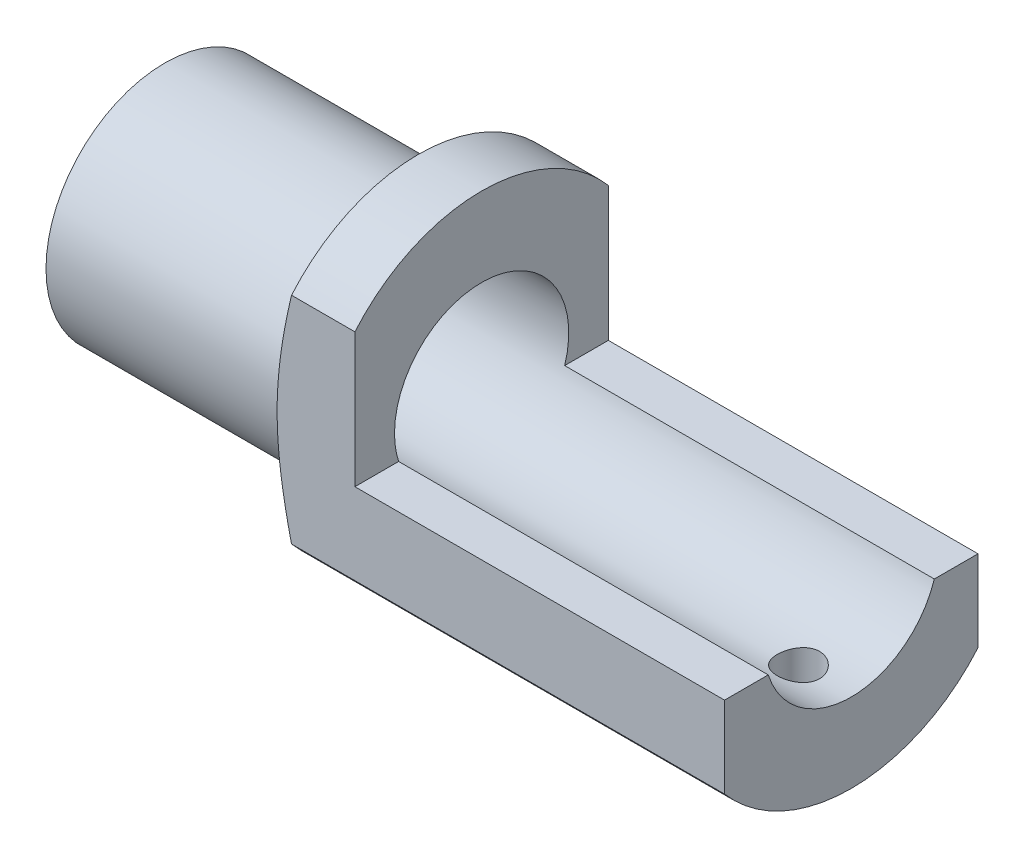
ISO-10303-21;
HEADER;
FILE_DESCRIPTION(('STEP AP214'),'2;1');
FILE_NAME('part.step','',(''),(''),'','','');
FILE_SCHEMA(('AUTOMOTIVE_DESIGN { 1 0 10303 214 1 1 1 1 }'));
ENDSEC;
DATA;
#1=APPLICATION_CONTEXT('core data for automotive mechanical design processes');
#2=APPLICATION_PROTOCOL_DEFINITION('international standard','automotive_design',2000,#1);
#3=PRODUCT_CONTEXT('',#1,'mechanical');
#4=PRODUCT('Part','Part','',(#3));
#5=PRODUCT_RELATED_PRODUCT_CATEGORY('part','',(#4));
#6=PRODUCT_DEFINITION_FORMATION('','',#4);
#7=PRODUCT_DEFINITION_CONTEXT('part definition',#1,'design');
#8=PRODUCT_DEFINITION('design','',#6,#7);
#9=PRODUCT_DEFINITION_SHAPE('','',#8);
#10=(LENGTH_UNIT() NAMED_UNIT(*) SI_UNIT(.MILLI.,.METRE.));
#11=(NAMED_UNIT(*) PLANE_ANGLE_UNIT() SI_UNIT($,.RADIAN.));
#12=(NAMED_UNIT(*) SI_UNIT($,.STERADIAN.) SOLID_ANGLE_UNIT());
#13=UNCERTAINTY_MEASURE_WITH_UNIT(LENGTH_MEASURE(1.E-05),#10,'distance_accuracy_value','');
#14=(GEOMETRIC_REPRESENTATION_CONTEXT(3) GLOBAL_UNCERTAINTY_ASSIGNED_CONTEXT((#13)) GLOBAL_UNIT_ASSIGNED_CONTEXT((#10,
#11,#12)) REPRESENTATION_CONTEXT('',''));
#15=CARTESIAN_POINT('',(0.,0.,0.));
#16=DIRECTION('',(0.,0.,1.));
#17=DIRECTION('',(1.,0.,0.));
#18=AXIS2_PLACEMENT_3D('',#15,#16,#17);
#19=CARTESIAN_POINT('',(13.,1.65,0.));
#20=DIRECTION('',(-1.,0.,0.));
#21=DIRECTION('',(0.,0.,1.));
#22=AXIS2_PLACEMENT_3D('',#19,#20,#21);
#23=PLANE('',#22);
#24=DIRECTION('',(0.,-1.,0.));
#25=VECTOR('',#24,1.);
#26=CARTESIAN_POINT('',(13.,0.554889711844842,2.4));
#27=LINE('',#26,#25);
#28=CARTESIAN_POINT('',(13.,-0.5,2.4));
#29=VERTEX_POINT('',#28);
#30=CARTESIAN_POINT('',(13.,-2.04022057631032,2.4));
#31=VERTEX_POINT('',#30);
#32=EDGE_CURVE('E104',#29,#31,#27,.T.);
#33=ORIENTED_EDGE('',*,*,#32,.T.);
#34=CARTESIAN_POINT('',(13.,0.,0.));
#35=DIRECTION('',(-1.,0.,0.));
#36=DIRECTION('',(0.,0.,1.));
#37=AXIS2_PLACEMENT_3D('',#34,#35,#36);
#38=CIRCLE('',#37,3.15);
#39=CARTESIAN_POINT('',(13.,-2.04022057631032,-2.4));
#40=VERTEX_POINT('',#39);
#41=EDGE_CURVE('E113',#40,#31,#38,.T.);
#42=ORIENTED_EDGE('',*,*,#41,.F.);
#43=DIRECTION('',(0.,-1.,0.));
#44=VECTOR('',#43,1.);
#45=CARTESIAN_POINT('',(13.,0.554889711844842,-2.4));
#46=LINE('',#45,#44);
#47=CARTESIAN_POINT('',(13.,-0.5,-2.4));
#48=VERTEX_POINT('',#47);
#49=EDGE_CURVE('E214',#48,#40,#46,.T.);
#50=ORIENTED_EDGE('',*,*,#49,.F.);
#51=DIRECTION('',(0.,0.,-1.));
#52=VECTOR('',#51,1.);
#53=CARTESIAN_POINT('',(13.,-0.5,-7.07142135623731));
#54=LINE('',#53,#52);
#55=CARTESIAN_POINT('',(13.,-0.5,-1.57241851935164));
#56=VERTEX_POINT('',#55);
#57=EDGE_CURVE('E240',#56,#48,#54,.T.);
#58=ORIENTED_EDGE('',*,*,#57,.F.);
#59=CARTESIAN_POINT('',(13.,0.,0.));
#60=DIRECTION('',(-1.,0.,0.));
#61=DIRECTION('',(0.,0.,1.));
#62=AXIS2_PLACEMENT_3D('',#59,#60,#61);
#63=CIRCLE('',#62,1.65);
#64=CARTESIAN_POINT('',(13.,-0.5,1.57241851935164));
#65=VERTEX_POINT('',#64);
#66=EDGE_CURVE('E119',#56,#65,#63,.T.);
#67=ORIENTED_EDGE('',*,*,#66,.T.);
#68=EDGE_CURVE('E115',#29,#65,#54,.T.);
#69=ORIENTED_EDGE('',*,*,#68,.F.);
#70=EDGE_LOOP('',(#33,#42,#50,#58,#67,#69));
#71=FACE_BOUND('',#70,.T.);
#72=ADVANCED_FACE('F33',(#71),#23,.F.);
#73=CARTESIAN_POINT('',(0.,0.,0.));
#74=DIRECTION('',(-1.,0.,0.));
#75=DIRECTION('',(0.,0.,1.));
#76=AXIS2_PLACEMENT_3D('',#73,#74,#75);
#77=CYLINDRICAL_SURFACE('',#76,3.15);
#78=CARTESIAN_POINT('',(12.,-3.1244999599936,0.4));
#79=CARTESIAN_POINT('',(12.0223707789781,-3.12450028579568,0.39999905067871));
#80=CARTESIAN_POINT('',(12.0447554674382,-3.12474280990166,0.398116972338436));
#81=CARTESIAN_POINT('',(12.0889016652716,-3.12568631387476,0.390638865972868));
#82=CARTESIAN_POINT('',(12.1106625020314,-3.12638777047604,0.385038975835159));
#83=CARTESIAN_POINT('',(12.1529154519492,-3.12816843582754,0.37029317801859));
#84=CARTESIAN_POINT('',(12.1734084232477,-3.12924738570986,0.361149699911176));
#85=CARTESIAN_POINT('',(12.2125653617999,-3.13166115562978,0.339581516200343));
#86=CARTESIAN_POINT('',(12.2312296365391,-3.13299593253946,0.327157363527449));
#87=CARTESIAN_POINT('',(12.2663108417287,-3.13577958696399,0.299303717000151));
#88=CARTESIAN_POINT('',(12.2827156906102,-3.13722901721862,0.283859060153672));
#89=CARTESIAN_POINT('',(12.3127079850487,-3.14007369603757,0.250435471418247));
#90=CARTESIAN_POINT('',(12.326295289402,-3.14146894188355,0.232456412591379));
#91=CARTESIAN_POINT('',(12.3503102338035,-3.14405371170858,0.194398330355441));
#92=CARTESIAN_POINT('',(12.3607269248587,-3.14524251685718,0.17431234507218));
#93=CARTESIAN_POINT('',(12.37803481191,-3.14727438052595,0.132658494406612));
#94=CARTESIAN_POINT('',(12.3849261427648,-3.14811745227151,0.111090685745526));
#95=CARTESIAN_POINT('',(12.3949515514423,-3.1493589644945,0.0672090533447429));
#96=CARTESIAN_POINT('',(12.3981057281432,-3.14975978265779,0.0448998898383334));
#97=CARTESIAN_POINT('',(12.4006295910112,-3.15007974784413,6.55406434916016E-05));
#98=CARTESIAN_POINT('',(12.3999994305496,-3.14999891438752,-0.0224596362534315));
#99=CARTESIAN_POINT('',(12.3949885966707,-3.14936660614305,-0.0669498309707091));
#100=CARTESIAN_POINT('',(12.3906295396446,-3.14881784399363,-0.0889173273782082));
#101=CARTESIAN_POINT('',(12.3783184513179,-3.14731438245107,-0.131806452935487));
#102=CARTESIAN_POINT('',(12.3703663498718,-3.14635967513285,-0.152728061657992));
#103=CARTESIAN_POINT('',(12.3510719790905,-3.1441469232437,-0.192998335120453));
#104=CARTESIAN_POINT('',(12.3397203737279,-3.14288804519476,-0.212342479107475));
#105=CARTESIAN_POINT('',(12.3139560188759,-3.14020775436818,-0.248859400504025));
#106=CARTESIAN_POINT('',(12.2995431245216,-3.13878633390026,-0.266032075094867));
#107=CARTESIAN_POINT('',(12.2679442980326,-3.1359281592755,-0.297845615255187));
#108=CARTESIAN_POINT('',(12.250739524472,-3.13449136767874,-0.312467769554457));
#109=CARTESIAN_POINT('',(12.2141099924757,-3.13177427254381,-0.338619725789632));
#110=CARTESIAN_POINT('',(12.194685226674,-3.1304939695249,-0.350149517464488));
#111=CARTESIAN_POINT('',(12.1541502290875,-3.12823482916814,-0.369790636211338));
#112=CARTESIAN_POINT('',(12.1330392480293,-3.12725612679615,-0.377900433436968));
#113=CARTESIAN_POINT('',(12.0897398853271,-3.1257136111063,-0.390454600220488));
#114=CARTESIAN_POINT('',(12.0675515573857,-3.12514977713104,-0.39489915228199));
#115=CARTESIAN_POINT('',(12.0228926918031,-3.12450462423838,-0.399971819758511));
#116=CARTESIAN_POINT('',(12.0004251930886,-3.1244199744022,-0.400626281693904));
#117=CARTESIAN_POINT('',(11.955700869559,-3.12473396220683,-0.398169735836227));
#118=CARTESIAN_POINT('',(11.9334440401169,-3.12513258920841,-0.395058810937208));
#119=CARTESIAN_POINT('',(11.8898519936737,-3.12636517439419,-0.385181994286194));
#120=CARTESIAN_POINT('',(11.8685138332928,-3.12719760953625,-0.378428886869152));
#121=CARTESIAN_POINT('',(11.8272727017425,-3.1292027798943,-0.361472571257207));
#122=CARTESIAN_POINT('',(11.807369782553,-3.13037552742763,-0.351269238181941));
#123=CARTESIAN_POINT('',(11.7694449840538,-3.13293715240888,-0.327637436543749));
#124=CARTESIAN_POINT('',(11.7514339390159,-3.13432717210138,-0.314191706765579));
#125=CARTESIAN_POINT('',(11.7179147617889,-3.1371631453275,-0.284481157715114));
#126=CARTESIAN_POINT('',(11.7024067301838,-3.13860910110603,-0.268216225207051));
#127=CARTESIAN_POINT('',(11.6742410940226,-3.14140426844521,-0.233213811667295));
#128=CARTESIAN_POINT('',(11.6616008126776,-3.14275286016212,-0.214462334454946));
#129=CARTESIAN_POINT('',(11.639649414153,-3.14519205417118,-0.175087090518309));
#130=CARTESIAN_POINT('',(11.6303382280398,-3.1462826618051,-0.154463362572679));
#131=CARTESIAN_POINT('',(11.615337869389,-3.14808025683615,-0.111986358820647));
#132=CARTESIAN_POINT('',(11.6096387247847,-3.14878829960707,-0.090136651070058));
#133=CARTESIAN_POINT('',(11.6019917982216,-3.14974537358259,-0.0457808524002871));
#134=CARTESIAN_POINT('',(11.60004384141,-3.14999442618191,-0.0232747921250696));
#135=CARTESIAN_POINT('',(11.5999579261811,-3.15000534931544,0.0215857826072003));
#136=CARTESIAN_POINT('',(11.6017932713957,-3.14977063349876,0.043940249797542));
#137=CARTESIAN_POINT('',(11.6091652702564,-3.14884718496051,0.088020263267153));
#138=CARTESIAN_POINT('',(11.6147019207467,-3.14815845262601,0.109745810082609));
#139=CARTESIAN_POINT('',(11.6293108999924,-3.14640401151155,0.151947492920995));
#140=CARTESIAN_POINT('',(11.6383819076962,-3.14533844359673,0.172424092464761));
#141=CARTESIAN_POINT('',(11.6597993407709,-3.14294825153939,0.211568667881042));
#142=CARTESIAN_POINT('',(11.6721458101188,-3.14162362391875,0.230236619465713));
#143=CARTESIAN_POINT('',(11.6998623149924,-3.13885197856298,0.265370309354557));
#144=CARTESIAN_POINT('',(11.7152522063379,-3.1374041947083,0.281820324184737));
#145=CARTESIAN_POINT('',(11.7485773798218,-3.1345555239931,0.31191470705552));
#146=CARTESIAN_POINT('',(11.7665132634835,-3.13315464831218,0.32555841019814));
#147=CARTESIAN_POINT('',(11.8045034421642,-3.13055245400674,0.349699571980219));
#148=CARTESIAN_POINT('',(11.8245658925023,-3.12935195267939,0.360184279011251));
#149=CARTESIAN_POINT('',(11.866170921751,-3.12729600919977,0.377620765501319));
#150=CARTESIAN_POINT('',(11.8877118672664,-3.12644019320904,0.384576374684652));
#151=CARTESIAN_POINT('',(11.9244694001303,-3.12537759004158,0.393098250873323));
#152=CARTESIAN_POINT('',(11.9394544552241,-3.12505012544717,0.39568266785411));
#153=CARTESIAN_POINT('',(11.9696242032752,-3.12461120066002,0.399133857930159));
#154=CARTESIAN_POINT('',(11.9848088946484,-3.12449973875438,0.400000644646292));
#155=CARTESIAN_POINT('',(12.,-3.1244999599936,0.4));
#156=B_SPLINE_CURVE_WITH_KNOTS('',3,(#78,#79,#80,#81,#82,#83,#84,#85,#86,#87,#88,#89,#90,#91,
#92,#93,#94,#95,#96,#97,#98,#99,#100,#101,#102,#103,#104,#105,#106,#107,#108,#109,#110,#111,
#112,#113,#114,#115,#116,#117,#118,#119,#120,#121,#122,#123,#124,#125,#126,#127,#128,#129,#130,
#131,#132,#133,#134,#135,#136,#137,#138,#139,#140,#141,#142,#143,#144,#145,#146,#147,#148,#149,
#150,#151,#152,#153,#154,#155),.UNSPECIFIED.,.T.,.F.,(4,2,2,2,2,2,2,2,2,2,2,2,2,2,2,2,2,2,2,2,2,
2,2,2,2,2,2,2,2,2,2,2,2,2,2,2,2,2,4),(0.,0.0670568391932324,0.134183447148531,0.201264112632664,
0.268333479434599,0.335748603228831,0.403167104773884,0.470815846331627,0.538461999872588,
0.605742668326027,0.673020610053551,0.739911164587162,0.806803025052902,0.873880301474584,
0.940960752804876,1.00851432666348,1.07606812467494,1.14365210916502,1.21123272824142,
1.2783429966033,1.34545178757625,1.41232654027398,1.47920371375176,1.5464450948866,
1.61368917745707,1.68132924319798,1.74896790827565,1.81641901471517,1.88386697700491,
1.95084063124669,2.0178142283883,2.0847628165033,2.15171230352819,2.21911391715884,
2.28653148187047,2.35421764673431,2.42183020163337,2.46736619248519,2.5129018222335),.UNSPECIFIED.);
#157=CARTESIAN_POINT('',(12.,-3.1244999599936,0.4));
#158=VERTEX_POINT('',#157);
#159=EDGE_CURVE('E137',#158,#158,#156,.T.);
#160=ORIENTED_EDGE('',*,*,#159,.T.);
#161=EDGE_LOOP('',(#160));
#162=FACE_BOUND('',#161,.T.);
#163=ORIENTED_EDGE('',*,*,#41,.T.);
#164=DIRECTION('',(1.,0.,0.));
#165=VECTOR('',#164,1.);
#166=CARTESIAN_POINT('',(0.,-2.04022057631032,2.4));
#167=LINE('',#166,#165);
#168=CARTESIAN_POINT('',(4.8,-2.04022057631032,2.4));
#169=VERTEX_POINT('',#168);
#170=EDGE_CURVE('E101',#169,#31,#167,.T.);
#171=ORIENTED_EDGE('',*,*,#170,.F.);
#172=CARTESIAN_POINT('',(4.8,0.,0.));
#173=DIRECTION('',(1.,0.,0.));
#174=DIRECTION('',(0.,0.,-1.));
#175=AXIS2_PLACEMENT_3D('',#172,#173,#174);
#176=CIRCLE('',#175,3.15);
#177=CARTESIAN_POINT('',(4.8,-2.04022057631032,-2.4));
#178=VERTEX_POINT('',#177);
#179=EDGE_CURVE('E60',#169,#178,#176,.T.);
#180=ORIENTED_EDGE('',*,*,#179,.T.);
#181=DIRECTION('',(1.,0.,0.));
#182=VECTOR('',#181,1.);
#183=CARTESIAN_POINT('',(0.,-2.04022057631032,-2.4));
#184=LINE('',#183,#182);
#185=EDGE_CURVE('E118',#178,#40,#184,.T.);
#186=ORIENTED_EDGE('',*,*,#185,.T.);
#187=EDGE_LOOP('',(#163,#171,#180,#186));
#188=FACE_BOUND('',#187,.T.);
#189=ADVANCED_FACE('F117',(#162,#188),#77,.T.);
#190=CARTESIAN_POINT('',(-2.78096834219185,-0.5,-7.07142135623731));
#191=DIRECTION('',(0.,-1.,0.));
#192=DIRECTION('',(0.,0.,-1.));
#193=AXIS2_PLACEMENT_3D('',#190,#191,#192);
#194=PLANE('',#193);
#195=DIRECTION('',(-1.,0.,0.));
#196=VECTOR('',#195,1.);
#197=CARTESIAN_POINT('',(-2.78096834219185,-0.5,2.4));
#198=LINE('',#197,#196);
#199=CARTESIAN_POINT('',(6.,-0.5,2.4));
#200=VERTEX_POINT('',#199);
#201=EDGE_CURVE('E220',#29,#200,#198,.T.);
#202=ORIENTED_EDGE('',*,*,#201,.F.);
#203=ORIENTED_EDGE('',*,*,#68,.T.);
#204=DIRECTION('',(1.,0.,0.));
#205=VECTOR('',#204,1.);
#206=CARTESIAN_POINT('',(-2.78096834219185,-0.5,1.57241851935164));
#207=LINE('',#206,#205);
#208=CARTESIAN_POINT('',(6.,-0.5,1.57241851935164));
#209=VERTEX_POINT('',#208);
#210=EDGE_CURVE('E232',#209,#65,#207,.T.);
#211=ORIENTED_EDGE('',*,*,#210,.F.);
#212=DIRECTION('',(0.,0.,1.));
#213=VECTOR('',#212,1.);
#214=CARTESIAN_POINT('',(6.,-0.5,-7.07142135623731));
#215=LINE('',#214,#213);
#216=EDGE_CURVE('E228',#209,#200,#215,.T.);
#217=ORIENTED_EDGE('',*,*,#216,.T.);
#218=EDGE_LOOP('',(#202,#203,#211,#217));
#219=FACE_BOUND('',#218,.T.);
#220=ADVANCED_FACE('F191',(#219),#194,.F.);
#221=CARTESIAN_POINT('',(6.,3.15,0.));
#222=DIRECTION('',(1.,0.,0.));
#223=DIRECTION('',(0.,0.,-1.));
#224=AXIS2_PLACEMENT_3D('',#221,#222,#223);
#225=PLANE('',#224);
#226=CARTESIAN_POINT('',(6.,0.,0.));
#227=DIRECTION('',(1.,0.,0.));
#228=DIRECTION('',(0.,0.,-1.));
#229=AXIS2_PLACEMENT_3D('',#226,#227,#228);
#230=CIRCLE('',#229,3.15);
#231=CARTESIAN_POINT('',(6.,2.04022057631032,2.4));
#232=VERTEX_POINT('',#231);
#233=CARTESIAN_POINT('',(6.,2.04022057631032,-2.4));
#234=VERTEX_POINT('',#233);
#235=EDGE_CURVE('E230',#232,#234,#230,.F.);
#236=ORIENTED_EDGE('',*,*,#235,.F.);
#237=DIRECTION('',(0.,-1.,0.));
#238=VECTOR('',#237,1.);
#239=CARTESIAN_POINT('',(6.,3.15,2.4));
#240=LINE('',#239,#238);
#241=EDGE_CURVE('E107',#232,#200,#240,.T.);
#242=ORIENTED_EDGE('',*,*,#241,.T.);
#243=ORIENTED_EDGE('',*,*,#216,.F.);
#244=CARTESIAN_POINT('',(6.,0.,0.));
#245=DIRECTION('',(1.,0.,0.));
#246=DIRECTION('',(0.,0.,-1.));
#247=AXIS2_PLACEMENT_3D('',#244,#245,#246);
#248=CIRCLE('',#247,1.65);
#249=CARTESIAN_POINT('',(6.,-0.5,-1.57241851935164));
#250=VERTEX_POINT('',#249);
#251=EDGE_CURVE('E172',#250,#209,#248,.T.);
#252=ORIENTED_EDGE('',*,*,#251,.F.);
#253=DIRECTION('',(0.,0.,1.));
#254=VECTOR('',#253,1.);
#255=CARTESIAN_POINT('',(6.,-0.5,-7.07142135623731));
#256=LINE('',#255,#254);
#257=CARTESIAN_POINT('',(6.,-0.5,-2.4));
#258=VERTEX_POINT('',#257);
#259=EDGE_CURVE('E235',#258,#250,#256,.T.);
#260=ORIENTED_EDGE('',*,*,#259,.F.);
#261=DIRECTION('',(0.,-1.,0.));
#262=VECTOR('',#261,1.);
#263=CARTESIAN_POINT('',(6.,3.15,-2.4));
#264=LINE('',#263,#262);
#265=EDGE_CURVE('E215',#234,#258,#264,.T.);
#266=ORIENTED_EDGE('',*,*,#265,.F.);
#267=EDGE_LOOP('',(#236,#242,#243,#252,#260,#266));
#268=FACE_BOUND('',#267,.T.);
#269=ADVANCED_FACE('F161',(#268),#225,.T.);
#270=CARTESIAN_POINT('',(4.5,0.,0.));
#271=DIRECTION('',(1.,0.,0.));
#272=DIRECTION('',(0.,0.,-1.));
#273=AXIS2_PLACEMENT_3D('',#270,#271,#272);
#274=CONICAL_SURFACE('',#273,2.32575677416361,1.22173047639603);
#275=CARTESIAN_POINT('',(4.5,0.,0.));
#276=DIRECTION('',(1.,0.,0.));
#277=DIRECTION('',(0.,0.,-1.));
#278=AXIS2_PLACEMENT_3D('',#275,#276,#277);
#279=CIRCLE('',#278,2.32575677416361);
#280=CARTESIAN_POINT('',(4.5,0.,-2.32575677416361));
#281=VERTEX_POINT('',#280);
#282=EDGE_CURVE('E131',#281,#281,#279,.F.);
#283=ORIENTED_EDGE('',*,*,#282,.F.);
#284=EDGE_LOOP('',(#283));
#285=FACE_BOUND('',#284,.T.);
#286=ORIENTED_EDGE('',*,*,#179,.F.);
#287=CARTESIAN_POINT('',(5.46407047863291,-4.35727388961923,2.4));
#288=CARTESIAN_POINT('',(5.42669694980541,-4.24002130930115,2.4));
#289=CARTESIAN_POINT('',(5.38962867280827,-4.1226701703377,2.4));
#290=CARTESIAN_POINT('',(5.31627073766991,-3.88771953296638,2.4));
#291=CARTESIAN_POINT('',(5.2799811125539,-3.77012002425577,2.4));
#292=CARTESIAN_POINT('',(5.20833753086117,-3.53458444844181,2.4));
#293=CARTESIAN_POINT('',(5.17298395253765,-3.41664826598908,2.4));
#294=CARTESIAN_POINT('',(5.10346116420305,-3.18042766172044,2.4));
#295=CARTESIAN_POINT('',(5.06929194328252,-3.06214324312313,2.4));
#296=CARTESIAN_POINT('',(5.0027673247053,-2.82631893374267,2.4));
#297=CARTESIAN_POINT('',(4.97039739491359,-2.70878315946497,2.4));
#298=CARTESIAN_POINT('',(4.9074973874617,-2.47322112730624,2.4));
#299=CARTESIAN_POINT('',(4.8769672775219,-2.35519487806944,2.4));
#300=CARTESIAN_POINT('',(4.81822737091367,-2.11849204886095,2.4));
#301=CARTESIAN_POINT('',(4.7900188225624,-1.99981515514287,2.4));
#302=CARTESIAN_POINT('',(4.73658292277888,-1.76180021311783,2.4));
#303=CARTESIAN_POINT('',(4.71135554774703,-1.64246217005251,2.4));
#304=CARTESIAN_POINT('',(4.64479623148707,-1.30111806555658,2.4));
#305=CARTESIAN_POINT('',(4.60802516308214,-1.07815190791642,2.4));
#306=CARTESIAN_POINT('',(4.56702921508705,-0.742145922299226,2.4));
#307=CARTESIAN_POINT('',(4.55572704010216,-0.629965202942296,2.4));
#308=CARTESIAN_POINT('',(4.53848172367656,-0.405185568129831,2.4));
#309=CARTESIAN_POINT('',(4.53253834802895,-0.292586671166791,2.4));
#310=CARTESIAN_POINT('',(4.52638991082147,-0.0665643203531632,2.4));
#311=CARTESIAN_POINT('',(4.52621892424874,0.0468600777695903,2.4));
#312=CARTESIAN_POINT('',(4.53171410920126,0.27356671256549,2.4));
#313=CARTESIAN_POINT('',(4.53738040945945,0.386848946048236,2.4));
#314=CARTESIAN_POINT('',(4.55417604253242,0.613163657391041,2.4));
#315=CARTESIAN_POINT('',(4.56531324393291,0.726195539265347,2.4));
#316=CARTESIAN_POINT('',(4.59239157369104,0.951669607657188,2.4));
#317=CARTESIAN_POINT('',(4.60833264371748,1.06411180131817,2.4));
#318=CARTESIAN_POINT('',(4.65099701913396,1.33048934857976,2.4));
#319=CARTESIAN_POINT('',(4.67952088181211,1.48413384812477,2.4));
#320=CARTESIAN_POINT('',(4.74230734441723,1.79025828563862,2.4));
#321=CARTESIAN_POINT('',(4.77657139811592,1.94273791833635,2.4));
#322=CARTESIAN_POINT('',(4.84934767909488,2.2468137711399,2.4));
#323=CARTESIAN_POINT('',(4.88786368919533,2.39840907619958,2.4));
#324=CARTESIAN_POINT('',(4.96799395371869,2.70075675100054,2.4));
#325=CARTESIAN_POINT('',(5.0096079283326,2.85150919555013,2.4));
#326=CARTESIAN_POINT('',(5.09528649674613,3.15289162268307,2.4));
#327=CARTESIAN_POINT('',(5.13935927235642,3.30351926704048,2.4));
#328=CARTESIAN_POINT('',(5.22925040409629,3.60425400979377,2.4));
#329=CARTESIAN_POINT('',(5.27506879606694,3.75436109743244,2.4));
#330=CARTESIAN_POINT('',(5.41444751204499,4.20390830266439,2.4));
#331=CARTESIAN_POINT('',(5.50997846320591,4.50273622500811,2.4));
#332=CARTESIAN_POINT('',(5.70341452678866,5.09685541108795,2.4));
#333=CARTESIAN_POINT('',(5.80129316160401,5.39215537356505,2.4));
#334=CARTESIAN_POINT('',(5.99912636566274,5.98210998949875,2.4));
#335=CARTESIAN_POINT('',(6.09908126027238,6.27676453369253,2.4));
#336=CARTESIAN_POINT('',(6.29959497484481,6.86327001488511,2.4));
#337=CARTESIAN_POINT('',(6.40014279816954,7.15512472163548,2.4));
#338=CARTESIAN_POINT('',(6.60222908092157,7.73843172277246,2.4));
#339=CARTESIAN_POINT('',(6.70376735676684,8.02988408071795,2.4));
#340=CARTESIAN_POINT('',(6.80562631218978,8.32122307178094,2.4));
#341=B_SPLINE_CURVE_WITH_KNOTS('',3,(#287,#288,#289,#290,#291,#292,#293,#294,#295,#296,#297,
#298,#299,#300,#301,#302,#303,#304,#305,#306,#307,#308,#309,#310,#311,#312,#313,#314,#315,#316,
#317,#318,#319,#320,#321,#322,#323,#324,#325,#326,#327,#328,#329,#330,#331,#332,#333,#334,#335,
#336,#337,#338,#339,#340),.UNSPECIFIED.,.F.,.F.,(4,2,2,2,2,2,2,2,2,2,2,2,2,2,2,2,2,2,2,2,2,2,2,
2,2,2,4),(0.,0.369195817946183,0.738407263883017,1.1077656975809,1.47712072810596,
1.84284370924053,2.20856027189936,2.57447221487169,2.94038126101352,3.61762664797312,
3.9557663263171,4.29389122551252,4.63401176278906,4.97413980109361,5.3147584710786,
5.6553730052523,6.12402422496101,6.59279431610228,7.0619848691192,7.53113309601322,
8.00194822562045,8.47277302723803,9.41391699831814,10.3472041473281,11.2806386699383,
12.2067044300753,13.1326016861812),.UNSPECIFIED.);
#342=CARTESIAN_POINT('',(4.8,2.04022057631032,2.4));
#343=VERTEX_POINT('',#342);
#344=EDGE_CURVE('E12',#169,#343,#341,.T.);
#345=ORIENTED_EDGE('',*,*,#344,.T.);
#346=CARTESIAN_POINT('',(4.8,2.04022057631032,-2.4));
#347=VERTEX_POINT('',#346);
#348=EDGE_CURVE('E134',#347,#343,#176,.T.);
#349=ORIENTED_EDGE('',*,*,#348,.F.);
#350=CARTESIAN_POINT('',(5.46407047863291,-4.35727388961923,-2.4));
#351=CARTESIAN_POINT('',(5.42669694980541,-4.24002130930115,-2.4));
#352=CARTESIAN_POINT('',(5.38962867280827,-4.1226701703377,-2.4));
#353=CARTESIAN_POINT('',(5.31627073766991,-3.88771953296638,-2.4));
#354=CARTESIAN_POINT('',(5.2799811125539,-3.77012002425577,-2.4));
#355=CARTESIAN_POINT('',(5.20833753086117,-3.53458444844181,-2.4));
#356=CARTESIAN_POINT('',(5.17298395253764,-3.41664826598908,-2.4));
#357=CARTESIAN_POINT('',(5.10346116420305,-3.18042766172044,-2.4));
#358=CARTESIAN_POINT('',(5.06929194328252,-3.06214324312313,-2.4));
#359=CARTESIAN_POINT('',(5.0027673247053,-2.82631893374267,-2.4));
#360=CARTESIAN_POINT('',(4.97039739491359,-2.70878315946497,-2.4));
#361=CARTESIAN_POINT('',(4.9074973874617,-2.47322112730623,-2.4));
#362=CARTESIAN_POINT('',(4.8769672775219,-2.35519487806944,-2.4));
#363=CARTESIAN_POINT('',(4.81822737091367,-2.11849204886095,-2.4));
#364=CARTESIAN_POINT('',(4.7900188225624,-1.99981515514286,-2.4));
#365=CARTESIAN_POINT('',(4.73658292277888,-1.76180021311783,-2.4));
#366=CARTESIAN_POINT('',(4.71135554774703,-1.64246217005251,-2.4));
#367=CARTESIAN_POINT('',(4.64479623148707,-1.30111806555658,-2.4));
#368=CARTESIAN_POINT('',(4.60802516308214,-1.07815190791642,-2.4));
#369=CARTESIAN_POINT('',(4.56702921508705,-0.742145922299226,-2.4));
#370=CARTESIAN_POINT('',(4.55572704010216,-0.629965202942297,-2.4));
#371=CARTESIAN_POINT('',(4.53848172367656,-0.405185568129832,-2.4));
#372=CARTESIAN_POINT('',(4.53253834802895,-0.292586671166792,-2.4));
#373=CARTESIAN_POINT('',(4.52638991082147,-0.0665643203531649,-2.4));
#374=CARTESIAN_POINT('',(4.52621892424874,0.0468600777695887,-2.4));
#375=CARTESIAN_POINT('',(4.53171410920126,0.273566712565488,-2.4));
#376=CARTESIAN_POINT('',(4.53738040945945,0.386848946048234,-2.4));
#377=CARTESIAN_POINT('',(4.55417604253242,0.61316365739104,-2.4));
#378=CARTESIAN_POINT('',(4.56531324393291,0.726195539265345,-2.4));
#379=CARTESIAN_POINT('',(4.59239157369104,0.951669607657186,-2.4));
#380=CARTESIAN_POINT('',(4.60833264371748,1.06411180131817,-2.4));
#381=CARTESIAN_POINT('',(4.65099701913396,1.33048934857976,-2.4));
#382=CARTESIAN_POINT('',(4.6795208818121,1.48413384812477,-2.4));
#383=CARTESIAN_POINT('',(4.74230734441723,1.79025828563862,-2.4));
#384=CARTESIAN_POINT('',(4.77657139811592,1.94273791833635,-2.4));
#385=CARTESIAN_POINT('',(4.84934767909488,2.2468137711399,-2.4));
#386=CARTESIAN_POINT('',(4.88786368919533,2.39840907619958,-2.4));
#387=CARTESIAN_POINT('',(4.96799395371869,2.70075675100054,-2.4));
#388=CARTESIAN_POINT('',(5.0096079283326,2.85150919555013,-2.4));
#389=CARTESIAN_POINT('',(5.09528649674613,3.15289162268307,-2.4));
#390=CARTESIAN_POINT('',(5.13935927235642,3.30351926704048,-2.4));
#391=CARTESIAN_POINT('',(5.22925040409629,3.60425400979377,-2.4));
#392=CARTESIAN_POINT('',(5.27506879606694,3.75436109743244,-2.4));
#393=CARTESIAN_POINT('',(5.41444751204499,4.20390830266439,-2.4));
#394=CARTESIAN_POINT('',(5.50997846320591,4.50273622500811,-2.4));
#395=CARTESIAN_POINT('',(5.70341452678866,5.09685541108795,-2.4));
#396=CARTESIAN_POINT('',(5.80129316160401,5.39215537356505,-2.4));
#397=CARTESIAN_POINT('',(5.99912636566274,5.98210998949875,-2.4));
#398=CARTESIAN_POINT('',(6.09908126027238,6.27676453369253,-2.4));
#399=CARTESIAN_POINT('',(6.29959497484481,6.86327001488511,-2.4));
#400=CARTESIAN_POINT('',(6.40014279816954,7.15512472163548,-2.4));
#401=CARTESIAN_POINT('',(6.60222908092157,7.73843172277246,-2.4));
#402=CARTESIAN_POINT('',(6.70376735676685,8.02988408071795,-2.4));
#403=CARTESIAN_POINT('',(6.80562631218978,8.32122307178094,-2.4));
#404=B_SPLINE_CURVE_WITH_KNOTS('',3,(#350,#351,#352,#353,#354,#355,#356,#357,#358,#359,#360,
#361,#362,#363,#364,#365,#366,#367,#368,#369,#370,#371,#372,#373,#374,#375,#376,#377,#378,#379,
#380,#381,#382,#383,#384,#385,#386,#387,#388,#389,#390,#391,#392,#393,#394,#395,#396,#397,#398,
#399,#400,#401,#402,#403),.UNSPECIFIED.,.F.,.F.,(4,2,2,2,2,2,2,2,2,2,2,2,2,2,2,2,2,2,2,2,2,2,2,
2,2,2,4),(0.,0.369195817946182,0.738407263883017,1.1077656975809,1.47712072810596,
1.84284370924053,2.20856027189936,2.57447221487169,2.94038126101352,3.61762664797311,
3.9557663263171,4.29389122551251,4.63401176278906,4.9741398010936,5.3147584710786,
5.65537300525229,6.124024224961,6.59279431610228,7.0619848691192,7.53113309601322,
8.00194822562045,8.47277302723803,9.41391699831814,10.3472041473281,11.2806386699383,
12.2067044300753,13.1326016861812),.UNSPECIFIED.);
#405=EDGE_CURVE('E46',#178,#347,#404,.T.);
#406=ORIENTED_EDGE('',*,*,#405,.F.);
#407=EDGE_LOOP('',(#286,#345,#349,#406));
#408=FACE_BOUND('',#407,.T.);
#409=ADVANCED_FACE('F35',(#285,#408),#274,.T.);
#410=CARTESIAN_POINT('',(0.,2.25,0.));
#411=DIRECTION('',(1.,0.,0.));
#412=DIRECTION('',(0.,0.,-1.));
#413=AXIS2_PLACEMENT_3D('',#410,#411,#412);
#414=PLANE('',#413);
#415=CARTESIAN_POINT('',(0.,0.,0.));
#416=DIRECTION('',(-1.,0.,0.));
#417=DIRECTION('',(0.,0.,1.));
#418=AXIS2_PLACEMENT_3D('',#415,#416,#417);
#419=CIRCLE('',#418,1.65);
#420=CARTESIAN_POINT('',(0.,0.,1.65));
#421=VERTEX_POINT('',#420);
#422=EDGE_CURVE('E122',#421,#421,#419,.T.);
#423=ORIENTED_EDGE('',*,*,#422,.F.);
#424=EDGE_LOOP('',(#423));
#425=FACE_BOUND('',#424,.T.);
#426=CARTESIAN_POINT('',(0.,0.,0.));
#427=DIRECTION('',(-1.,0.,0.));
#428=DIRECTION('',(0.,0.,1.));
#429=AXIS2_PLACEMENT_3D('',#426,#427,#428);
#430=CIRCLE('',#429,2.25);
#431=CARTESIAN_POINT('',(0.,0.,2.25));
#432=VERTEX_POINT('',#431);
#433=EDGE_CURVE('E125',#432,#432,#430,.T.);
#434=ORIENTED_EDGE('',*,*,#433,.T.);
#435=EDGE_LOOP('',(#434));
#436=FACE_BOUND('',#435,.T.);
#437=ADVANCED_FACE('F177',(#425,#436),#414,.F.);
#438=CARTESIAN_POINT('',(0.,0.,0.));
#439=DIRECTION('',(-1.,0.,0.));
#440=DIRECTION('',(0.,0.,1.));
#441=AXIS2_PLACEMENT_3D('',#438,#439,#440);
#442=CYLINDRICAL_SURFACE('',#441,1.65);
#443=CARTESIAN_POINT('',(12.,-1.60078105935821,0.4));
#444=CARTESIAN_POINT('',(11.9778889939897,-1.60078149268384,0.399999334870328));
#445=CARTESIAN_POINT('',(11.955770476015,-1.60124417637013,0.398160394624138));
#446=CARTESIAN_POINT('',(11.9121670446289,-1.60304053350639,0.390864004361595));
#447=CARTESIAN_POINT('',(11.8906825309667,-1.60437474470105,0.385404320263816));
#448=CARTESIAN_POINT('',(11.8489841112087,-1.60775437124044,0.371052250583911));
#449=CARTESIAN_POINT('',(11.8287686638779,-1.60979890339409,0.362164126311995));
#450=CARTESIAN_POINT('',(11.7901140522841,-1.61436771514119,0.341220274972143));
#451=CARTESIAN_POINT('',(11.7716749355805,-1.61689200757433,0.329164463124997));
#452=CARTESIAN_POINT('',(11.7367146009939,-1.62219439578771,0.301960974750249));
#453=CARTESIAN_POINT('',(11.7202355688604,-1.62497634720276,0.28675982478472));
#454=CARTESIAN_POINT('',(11.6900342760065,-1.6304470747054,0.253812412882786));
#455=CARTESIAN_POINT('',(11.6763122614438,-1.63313584245545,0.236065923930444));
#456=CARTESIAN_POINT('',(11.6518433690075,-1.63815974509339,0.198244132501644));
#457=CARTESIAN_POINT('',(11.6411377157135,-1.64048979926588,0.178141426502482));
#458=CARTESIAN_POINT('',(11.6232731424466,-1.64448986365978,0.136355973264544));
#459=CARTESIAN_POINT('',(11.6161137313031,-1.64615996528111,0.114673445315729));
#460=CARTESIAN_POINT('',(11.6056793791238,-1.64862469530258,0.0707833592577171));
#461=CARTESIAN_POINT('',(11.602332856909,-1.64943543588715,0.0485937390870254));
#462=CARTESIAN_POINT('',(11.5993948135155,-1.65014616065046,0.00395421876310928));
#463=CARTESIAN_POINT('',(11.5998027690245,-1.65004627175598,-0.0184956446808422));
#464=CARTESIAN_POINT('',(11.6043101528499,-1.64895906758376,-0.0625226908056017));
#465=CARTESIAN_POINT('',(11.6083323453869,-1.64799032050208,-0.0841083078444899));
#466=CARTESIAN_POINT('',(11.6198301532096,-1.64529574794821,-0.126288629957477));
#467=CARTESIAN_POINT('',(11.6273059459628,-1.64356988357083,-0.146883284049662));
#468=CARTESIAN_POINT('',(11.6455626927262,-1.63952621866866,-0.186703316323859));
#469=CARTESIAN_POINT('',(11.6563715833564,-1.63720344360788,-0.205915360197774));
#470=CARTESIAN_POINT('',(11.68096660713,-1.63221862672622,-0.242280273725787));
#471=CARTESIAN_POINT('',(11.6947532303618,-1.62955652908771,-0.259432803692016));
#472=CARTESIAN_POINT('',(11.7253280925948,-1.62410380258509,-0.291652159318641));
#473=CARTESIAN_POINT('',(11.7421838620919,-1.62131162706011,-0.306654705262366));
#474=CARTESIAN_POINT('',(11.7782012727878,-1.6159758824231,-0.333633964913931));
#475=CARTESIAN_POINT('',(11.7973630089381,-1.61343232355604,-0.345610553960769));
#476=CARTESIAN_POINT('',(11.8375688243153,-1.60887659470897,-0.366235807287706));
#477=CARTESIAN_POINT('',(11.8586206880101,-1.60686677113419,-0.374869850732624));
#478=CARTESIAN_POINT('',(11.9019374019615,-1.60363668306748,-0.38845679744401));
#479=CARTESIAN_POINT('',(11.9242020091509,-1.60241626098445,-0.393410435472537));
#480=CARTESIAN_POINT('',(11.9687182926563,-1.60093600589726,-0.399391088235947));
#481=CARTESIAN_POINT('',(11.9909564949012,-1.60065301765713,-0.400512776946921));
#482=CARTESIAN_POINT('',(12.035302268988,-1.60101678493774,-0.399056155249055));
#483=CARTESIAN_POINT('',(12.0574098518978,-1.60166346051503,-0.396478162982432));
#484=CARTESIAN_POINT('',(12.1005209149685,-1.60379158302124,-0.387778160584289));
#485=CARTESIAN_POINT('',(12.1215360568601,-1.60526021748094,-0.381710507191095));
#486=CARTESIAN_POINT('',(12.1622510913178,-1.60885476894273,-0.36626332561366));
#487=CARTESIAN_POINT('',(12.1819508350537,-1.61098076016854,-0.3568834234185));
#488=CARTESIAN_POINT('',(12.2198791881204,-1.61569976777602,-0.33487722590333));
#489=CARTESIAN_POINT('',(12.2380736937105,-1.61830072216576,-0.322193890964607));
#490=CARTESIAN_POINT('',(12.2721108932751,-1.62365675947033,-0.29401361243475));
#491=CARTESIAN_POINT('',(12.2879532241702,-1.62641186608976,-0.278516235289881));
#492=CARTESIAN_POINT('',(12.3172157879598,-1.63184371042954,-0.244714810963201));
#493=CARTESIAN_POINT('',(12.3305707636381,-1.63451711192285,-0.226353635646871));
#494=CARTESIAN_POINT('',(12.3540074409387,-1.63941741985165,-0.187594044415804));
#495=CARTESIAN_POINT('',(12.3640893101449,-1.64164434914439,-0.167195732872908));
#496=CARTESIAN_POINT('',(12.3806087769416,-1.64538702312804,-0.125079457244716));
#497=CARTESIAN_POINT('',(12.387071959897,-1.64690774752789,-0.103371991855496));
#498=CARTESIAN_POINT('',(12.3962483083329,-1.64908840580513,-0.0591375692642498));
#499=CARTESIAN_POINT('',(12.3989621515963,-1.64974849526165,-0.0366107609339136));
#500=CARTESIAN_POINT('',(12.4005265745059,-1.65012759592512,0.00800827085718597));
#501=CARTESIAN_POINT('',(12.3994737297411,-1.64987013327021,0.030096961291693));
#502=CARTESIAN_POINT('',(12.3937545499224,-1.64849478039091,0.0737726509318308));
#503=CARTESIAN_POINT('',(12.3890883108272,-1.64737691301575,0.0953596634445221));
#504=CARTESIAN_POINT('',(12.3763252802586,-1.64440952622058,0.137324767661609));
#505=CARTESIAN_POINT('',(12.3682450099538,-1.64256353316603,0.157708149541847));
#506=CARTESIAN_POINT('',(12.3488984596078,-1.63833493465068,0.196841204006329));
#507=CARTESIAN_POINT('',(12.3376317995901,-1.63595226519819,0.215590681398649));
#508=CARTESIAN_POINT('',(12.3119325804659,-1.6308403240449,0.25138507958388));
#509=CARTESIAN_POINT('',(12.2974338705276,-1.62810440410952,0.268381558332369));
#510=CARTESIAN_POINT('',(12.265811836591,-1.62262562572065,0.299733107432484));
#511=CARTESIAN_POINT('',(12.2486878578036,-1.6198827657045,0.314087516833653));
#512=CARTESIAN_POINT('',(12.2119455538584,-1.61464703924873,0.339989701921347));
#513=CARTESIAN_POINT('',(12.1922892745485,-1.61215930537798,0.35148475344866));
#514=CARTESIAN_POINT('',(12.1512661230895,-1.60778328914994,0.370989944911061));
#515=CARTESIAN_POINT('',(12.1299005630217,-1.60589455241459,0.379002728088868));
#516=CARTESIAN_POINT('',(12.0904635734917,-1.60323954274772,0.390061729230331));
#517=CARTESIAN_POINT('',(12.0725878397447,-1.60232433355276,0.393780715176108));
#518=CARTESIAN_POINT('',(12.0364764234814,-1.60109493554434,0.398750032804475));
#519=CARTESIAN_POINT('',(12.0182407679285,-1.60078070188048,0.400000548707551));
#520=CARTESIAN_POINT('',(12.,-1.60078105935821,0.4));
#521=B_SPLINE_CURVE_WITH_KNOTS('',3,(#443,#444,#445,#446,#447,#448,#449,#450,#451,#452,#453,
#454,#455,#456,#457,#458,#459,#460,#461,#462,#463,#464,#465,#466,#467,#468,#469,#470,#471,#472,
#473,#474,#475,#476,#477,#478,#479,#480,#481,#482,#483,#484,#485,#486,#487,#488,#489,#490,#491,
#492,#493,#494,#495,#496,#497,#498,#499,#500,#501,#502,#503,#504,#505,#506,#507,#508,#509,#510,
#511,#512,#513,#514,#515,#516,#517,#518,#519,#520),.UNSPECIFIED.,.T.,.F.,(4,2,2,2,2,2,2,2,2,2,2,
2,2,2,2,2,2,2,2,2,2,2,2,2,2,2,2,2,2,2,2,2,2,2,2,2,2,2,4),(0.,0.0662660683072889,
0.132573062377454,0.198797905703109,0.26502452163471,0.332486350284541,0.399954199525237,
0.468303762105665,0.536643855313199,0.603678659839605,0.670704120960353,0.736330452481179,
0.8019601566675,0.868155622257961,0.934361990905919,1.00225529843247,1.0701514025184,
1.13834122711825,1.20651743453106,1.27299656642405,1.33946998199953,1.40493498270656,
1.47040737792411,1.53709534045533,1.60379358619588,1.67205057811412,1.7403040747057,
1.80806869619898,1.87582106601389,1.94184889624748,2.00787497308219,2.07358513154994,
2.13930312925154,2.20651516693216,2.27374399585528,2.34213330376749,2.41047060919002,
2.46514176214296,2.51980883486521),.UNSPECIFIED.);
#522=CARTESIAN_POINT('',(12.,-1.60078105935821,0.4));
#523=VERTEX_POINT('',#522);
#524=EDGE_CURVE('E143',#523,#523,#521,.T.);
#525=ORIENTED_EDGE('',*,*,#524,.T.);
#526=EDGE_LOOP('',(#525));
#527=FACE_BOUND('',#526,.T.);
#528=ORIENTED_EDGE('',*,*,#66,.F.);
#529=DIRECTION('',(1.,0.,0.));
#530=VECTOR('',#529,1.);
#531=CARTESIAN_POINT('',(-2.78096834219185,-0.5,-1.57241851935164));
#532=LINE('',#531,#530);
#533=EDGE_CURVE('E239',#250,#56,#532,.T.);
#534=ORIENTED_EDGE('',*,*,#533,.F.);
#535=ORIENTED_EDGE('',*,*,#251,.T.);
#536=ORIENTED_EDGE('',*,*,#210,.T.);
#537=EDGE_LOOP('',(#528,#534,#535,#536));
#538=FACE_BOUND('',#537,.T.);
#539=ORIENTED_EDGE('',*,*,#422,.T.);
#540=EDGE_LOOP('',(#539));
#541=FACE_BOUND('',#540,.T.);
#542=ADVANCED_FACE('F174',(#527,#538,#541),#442,.F.);
#543=ORIENTED_EDGE('',*,*,#348,.T.);
#544=DIRECTION('',(1.,0.,0.));
#545=VECTOR('',#544,1.);
#546=CARTESIAN_POINT('',(0.,2.04022057631032,2.4));
#547=LINE('',#546,#545);
#548=EDGE_CURVE('E53',#343,#232,#547,.T.);
#549=ORIENTED_EDGE('',*,*,#548,.T.);
#550=ORIENTED_EDGE('',*,*,#235,.T.);
#551=DIRECTION('',(1.,0.,0.));
#552=VECTOR('',#551,1.);
#553=CARTESIAN_POINT('',(0.,2.04022057631032,-2.4));
#554=LINE('',#553,#552);
#555=EDGE_CURVE('E209',#347,#234,#554,.T.);
#556=ORIENTED_EDGE('',*,*,#555,.F.);
#557=EDGE_LOOP('',(#543,#549,#550,#556));
#558=FACE_BOUND('',#557,.T.);
#559=ADVANCED_FACE('F149',(#558),#77,.T.);
#560=CARTESIAN_POINT('',(4.5,3.15,0.));
#561=DIRECTION('',(1.,0.,0.));
#562=DIRECTION('',(0.,0.,-1.));
#563=AXIS2_PLACEMENT_3D('',#560,#561,#562);
#564=PLANE('',#563);
#565=ORIENTED_EDGE('',*,*,#282,.T.);
#566=EDGE_LOOP('',(#565));
#567=FACE_BOUND('',#566,.T.);
#568=CARTESIAN_POINT('',(4.5,0.,0.));
#569=DIRECTION('',(-1.,0.,0.));
#570=DIRECTION('',(0.,0.,1.));
#571=AXIS2_PLACEMENT_3D('',#568,#569,#570);
#572=CIRCLE('',#571,2.25);
#573=CARTESIAN_POINT('',(4.5,0.,2.25));
#574=VERTEX_POINT('',#573);
#575=EDGE_CURVE('E120',#574,#574,#572,.T.);
#576=ORIENTED_EDGE('',*,*,#575,.F.);
#577=EDGE_LOOP('',(#576));
#578=FACE_BOUND('',#577,.T.);
#579=ADVANCED_FACE('F198',(#567,#578),#564,.F.);
#580=CARTESIAN_POINT('',(0.,0.,0.));
#581=DIRECTION('',(-1.,0.,0.));
#582=DIRECTION('',(0.,0.,1.));
#583=AXIS2_PLACEMENT_3D('',#580,#581,#582);
#584=CYLINDRICAL_SURFACE('',#583,2.25);
#585=ORIENTED_EDGE('',*,*,#433,.F.);
#586=EDGE_LOOP('',(#585));
#587=FACE_BOUND('',#586,.T.);
#588=ORIENTED_EDGE('',*,*,#575,.T.);
#589=EDGE_LOOP('',(#588));
#590=FACE_BOUND('',#589,.T.);
#591=ADVANCED_FACE('F203',(#587,#590),#584,.T.);
#592=ORIENTED_EDGE('',*,*,#57,.T.);
#593=DIRECTION('',(-1.,0.,0.));
#594=VECTOR('',#593,1.);
#595=CARTESIAN_POINT('',(-2.78096834219185,-0.5,-2.4));
#596=LINE('',#595,#594);
#597=EDGE_CURVE('E144',#48,#258,#596,.T.);
#598=ORIENTED_EDGE('',*,*,#597,.T.);
#599=ORIENTED_EDGE('',*,*,#259,.T.);
#600=ORIENTED_EDGE('',*,*,#533,.T.);
#601=EDGE_LOOP('',(#592,#598,#599,#600));
#602=FACE_BOUND('',#601,.T.);
#603=ADVANCED_FACE('F158',(#602),#194,.F.);
#604=CARTESIAN_POINT('',(12.,-10.5,0.));
#605=DIRECTION('',(0.,1.,0.));
#606=DIRECTION('',(0.,0.,1.));
#607=AXIS2_PLACEMENT_3D('',#604,#605,#606);
#608=CYLINDRICAL_SURFACE('',#607,0.4);
#609=ORIENTED_EDGE('',*,*,#159,.F.);
#610=EDGE_LOOP('',(#609));
#611=FACE_BOUND('',#610,.T.);
#612=ORIENTED_EDGE('',*,*,#524,.F.);
#613=EDGE_LOOP('',(#612));
#614=FACE_BOUND('',#613,.T.);
#615=ADVANCED_FACE('F153',(#611,#614),#608,.F.);
#616=CARTESIAN_POINT('',(0.,0.554889711844842,-2.4));
#617=DIRECTION('',(0.,0.,1.));
#618=DIRECTION('',(1.,0.,0.));
#619=AXIS2_PLACEMENT_3D('',#616,#617,#618);
#620=PLANE('',#619);
#621=ORIENTED_EDGE('',*,*,#49,.T.);
#622=ORIENTED_EDGE('',*,*,#185,.F.);
#623=ORIENTED_EDGE('',*,*,#405,.T.);
#624=ORIENTED_EDGE('',*,*,#555,.T.);
#625=ORIENTED_EDGE('',*,*,#265,.T.);
#626=ORIENTED_EDGE('',*,*,#597,.F.);
#627=EDGE_LOOP('',(#621,#622,#623,#624,#625,#626));
#628=FACE_BOUND('',#627,.T.);
#629=ADVANCED_FACE('F157',(#628),#620,.F.);
#630=CARTESIAN_POINT('',(0.,0.554889711844842,2.4));
#631=DIRECTION('',(0.,0.,1.));
#632=DIRECTION('',(1.,0.,0.));
#633=AXIS2_PLACEMENT_3D('',#630,#631,#632);
#634=PLANE('',#633);
#635=ORIENTED_EDGE('',*,*,#201,.T.);
#636=ORIENTED_EDGE('',*,*,#241,.F.);
#637=ORIENTED_EDGE('',*,*,#548,.F.);
#638=ORIENTED_EDGE('',*,*,#344,.F.);
#639=ORIENTED_EDGE('',*,*,#170,.T.);
#640=ORIENTED_EDGE('',*,*,#32,.F.);
#641=EDGE_LOOP('',(#635,#636,#637,#638,#639,#640));
#642=FACE_BOUND('',#641,.T.);
#643=ADVANCED_FACE('F103',(#642),#634,.T.);
#644=CLOSED_SHELL('',(#72,#189,#220,#269,#409,#437,#542,#559,#579,#591,#603,#615,#629,#643));
#645=MANIFOLD_SOLID_BREP('B2',#644);
#646=ADVANCED_BREP_SHAPE_REPRESENTATION('',(#18,#645),#14);
#647=SHAPE_DEFINITION_REPRESENTATION(#9,#646);
ENDSEC;
END-ISO-10303-21;
